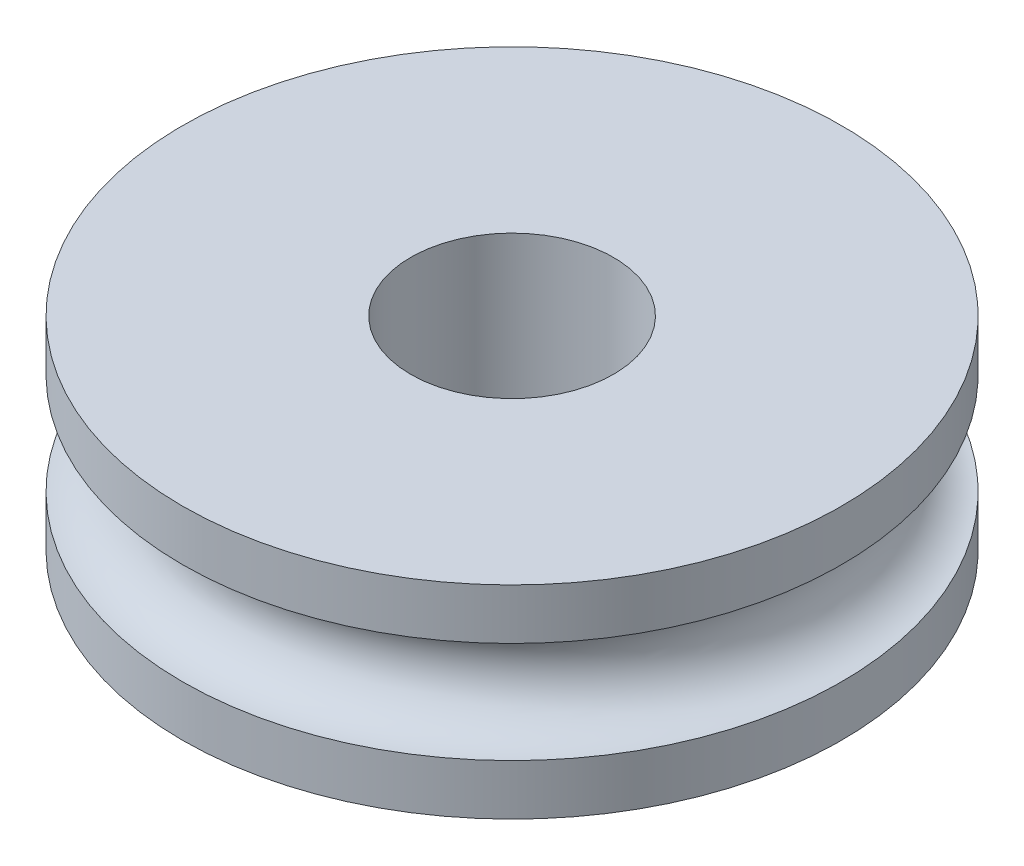
ISO-10303-21;
HEADER;
FILE_DESCRIPTION(('STEP AP214'),'2;1');
FILE_NAME('part.step','',(''),(''),'','','');
FILE_SCHEMA(('AUTOMOTIVE_DESIGN { 1 0 10303 214 1 1 1 1 }'));
ENDSEC;
DATA;
#1=APPLICATION_CONTEXT('core data for automotive mechanical design processes');
#2=APPLICATION_PROTOCOL_DEFINITION('international standard','automotive_design',2000,#1);
#3=PRODUCT_CONTEXT('',#1,'mechanical');
#4=PRODUCT('Part','Part','',(#3));
#5=PRODUCT_RELATED_PRODUCT_CATEGORY('part','',(#4));
#6=PRODUCT_DEFINITION_FORMATION('','',#4);
#7=PRODUCT_DEFINITION_CONTEXT('part definition',#1,'design');
#8=PRODUCT_DEFINITION('design','',#6,#7);
#9=PRODUCT_DEFINITION_SHAPE('','',#8);
#10=(LENGTH_UNIT() NAMED_UNIT(*) SI_UNIT(.MILLI.,.METRE.));
#11=(NAMED_UNIT(*) PLANE_ANGLE_UNIT() SI_UNIT($,.RADIAN.));
#12=(NAMED_UNIT(*) SI_UNIT($,.STERADIAN.) SOLID_ANGLE_UNIT());
#13=UNCERTAINTY_MEASURE_WITH_UNIT(LENGTH_MEASURE(1.E-05),#10,'distance_accuracy_value','');
#14=(GEOMETRIC_REPRESENTATION_CONTEXT(3) GLOBAL_UNCERTAINTY_ASSIGNED_CONTEXT((#13)) GLOBAL_UNIT_ASSIGNED_CONTEXT((#10,
#11,#12)) REPRESENTATION_CONTEXT('',''));
#15=CARTESIAN_POINT('',(0.,0.,0.));
#16=DIRECTION('',(0.,0.,1.));
#17=DIRECTION('',(1.,0.,0.));
#18=AXIS2_PLACEMENT_3D('',#15,#16,#17);
#19=CARTESIAN_POINT('',(76.5,54.52643198464,-44.43));
#20=DIRECTION('',(0.,1.,0.));
#21=DIRECTION('',(0.,0.,1.));
#22=AXIS2_PLACEMENT_3D('',#19,#20,#21);
#23=PLANE('',#22);
#24=CARTESIAN_POINT('',(74.5,54.52643198464,-44.43));
#25=DIRECTION('',(0.,1.,0.));
#26=DIRECTION('',(0.,0.,1.));
#27=AXIS2_PLACEMENT_3D('',#24,#25,#26);
#28=CIRCLE('',#27,6.50000000000001);
#29=CARTESIAN_POINT('',(74.5,54.52643198464,-37.93));
#30=VERTEX_POINT('',#29);
#31=EDGE_CURVE('E53',#30,#30,#28,.T.);
#32=ORIENTED_EDGE('',*,*,#31,.T.);
#33=EDGE_LOOP('',(#32));
#34=FACE_BOUND('',#33,.T.);
#35=CARTESIAN_POINT('',(74.5,54.52643198464,-44.43));
#36=DIRECTION('',(0.,1.,0.));
#37=DIRECTION('',(0.,0.,1.));
#38=AXIS2_PLACEMENT_3D('',#35,#36,#37);
#39=CIRCLE('',#38,2.);
#40=CARTESIAN_POINT('',(74.5,54.52643198464,-42.43));
#41=VERTEX_POINT('',#40);
#42=EDGE_CURVE('E10',#41,#41,#39,.T.);
#43=ORIENTED_EDGE('',*,*,#42,.F.);
#44=EDGE_LOOP('',(#43));
#45=FACE_BOUND('',#44,.T.);
#46=ADVANCED_FACE('F31',(#34,#45),#23,.T.);
#47=CARTESIAN_POINT('',(74.5,50.52643198464,-44.43));
#48=DIRECTION('',(0.,1.,0.));
#49=DIRECTION('',(0.,0.,1.));
#50=AXIS2_PLACEMENT_3D('',#47,#48,#49);
#51=CYLINDRICAL_SURFACE('',#50,2.);
#52=ORIENTED_EDGE('',*,*,#42,.T.);
#53=EDGE_LOOP('',(#52));
#54=FACE_BOUND('',#53,.T.);
#55=CARTESIAN_POINT('',(74.5,50.52643198464,-44.43));
#56=DIRECTION('',(0.,1.,0.));
#57=DIRECTION('',(0.,0.,1.));
#58=AXIS2_PLACEMENT_3D('',#55,#56,#57);
#59=CIRCLE('',#58,2.);
#60=CARTESIAN_POINT('',(74.5,50.52643198464,-42.43));
#61=VERTEX_POINT('',#60);
#62=EDGE_CURVE('E37',#61,#61,#59,.T.);
#63=ORIENTED_EDGE('',*,*,#62,.F.);
#64=EDGE_LOOP('',(#63));
#65=FACE_BOUND('',#64,.T.);
#66=ADVANCED_FACE('F71',(#54,#65),#51,.F.);
#67=CARTESIAN_POINT('',(81.,50.52643198464,-44.43));
#68=DIRECTION('',(0.,-1.,0.));
#69=DIRECTION('',(0.,0.,-1.));
#70=AXIS2_PLACEMENT_3D('',#67,#68,#69);
#71=PLANE('',#70);
#72=ORIENTED_EDGE('',*,*,#62,.T.);
#73=EDGE_LOOP('',(#72));
#74=FACE_BOUND('',#73,.T.);
#75=CARTESIAN_POINT('',(74.5,50.52643198464,-44.43));
#76=DIRECTION('',(0.,1.,0.));
#77=DIRECTION('',(0.,0.,1.));
#78=AXIS2_PLACEMENT_3D('',#75,#76,#77);
#79=CIRCLE('',#78,6.50000000000001);
#80=CARTESIAN_POINT('',(74.5,50.52643198464,-37.93));
#81=VERTEX_POINT('',#80);
#82=EDGE_CURVE('E41',#81,#81,#79,.T.);
#83=ORIENTED_EDGE('',*,*,#82,.F.);
#84=EDGE_LOOP('',(#83));
#85=FACE_BOUND('',#84,.T.);
#86=ADVANCED_FACE('F75',(#74,#85),#71,.T.);
#87=CARTESIAN_POINT('',(74.5,50.52643198464,-44.43));
#88=DIRECTION('',(0.,1.,0.));
#89=DIRECTION('',(0.,0.,1.));
#90=AXIS2_PLACEMENT_3D('',#87,#88,#89);
#91=CYLINDRICAL_SURFACE('',#90,6.50000000000001);
#92=ORIENTED_EDGE('',*,*,#82,.T.);
#93=EDGE_LOOP('',(#92));
#94=FACE_BOUND('',#93,.T.);
#95=CARTESIAN_POINT('',(74.5,51.52643198464,-44.43));
#96=DIRECTION('',(0.,1.,0.));
#97=DIRECTION('',(0.,0.,1.));
#98=AXIS2_PLACEMENT_3D('',#95,#96,#97);
#99=CIRCLE('',#98,6.50000000000001);
#100=CARTESIAN_POINT('',(74.5,51.52643198464,-37.93));
#101=VERTEX_POINT('',#100);
#102=EDGE_CURVE('E45',#101,#101,#99,.T.);
#103=ORIENTED_EDGE('',*,*,#102,.F.);
#104=EDGE_LOOP('',(#103));
#105=FACE_BOUND('',#104,.T.);
#106=ADVANCED_FACE('F67',(#94,#105),#91,.T.);
#107=CARTESIAN_POINT('',(74.5,52.52643198464,-44.43));
#108=DIRECTION('',(0.,1.,0.));
#109=DIRECTION('',(0.,0.,1.));
#110=AXIS2_PLACEMENT_3D('',#107,#108,#109);
#111=TOROIDAL_SURFACE('',#110,6.50000000000001,0.999999999999997);
#112=ORIENTED_EDGE('',*,*,#102,.T.);
#113=EDGE_LOOP('',(#112));
#114=FACE_BOUND('',#113,.T.);
#115=CARTESIAN_POINT('',(74.5,53.52643198464,-44.43));
#116=DIRECTION('',(0.,1.,0.));
#117=DIRECTION('',(0.,0.,1.));
#118=AXIS2_PLACEMENT_3D('',#115,#116,#117);
#119=CIRCLE('',#118,6.50000000000001);
#120=CARTESIAN_POINT('',(74.5,53.52643198464,-37.93));
#121=VERTEX_POINT('',#120);
#122=EDGE_CURVE('E50',#121,#121,#119,.T.);
#123=ORIENTED_EDGE('',*,*,#122,.F.);
#124=EDGE_LOOP('',(#123));
#125=FACE_BOUND('',#124,.T.);
#126=ADVANCED_FACE('F61',(#114,#125),#111,.F.);
#127=CARTESIAN_POINT('',(74.5,50.52643198464,-44.43));
#128=DIRECTION('',(0.,1.,0.));
#129=DIRECTION('',(0.,0.,1.));
#130=AXIS2_PLACEMENT_3D('',#127,#128,#129);
#131=CYLINDRICAL_SURFACE('',#130,6.50000000000001);
#132=ORIENTED_EDGE('',*,*,#122,.T.);
#133=EDGE_LOOP('',(#132));
#134=FACE_BOUND('',#133,.T.);
#135=ORIENTED_EDGE('',*,*,#31,.F.);
#136=EDGE_LOOP('',(#135));
#137=FACE_BOUND('',#136,.T.);
#138=ADVANCED_FACE('F59',(#134,#137),#131,.T.);
#139=CLOSED_SHELL('',(#46,#66,#86,#106,#126,#138));
#140=MANIFOLD_SOLID_BREP('B2',#139);
#141=ADVANCED_BREP_SHAPE_REPRESENTATION('',(#18,#140),#14);
#142=SHAPE_DEFINITION_REPRESENTATION(#9,#141);
ENDSEC;
END-ISO-10303-21;
